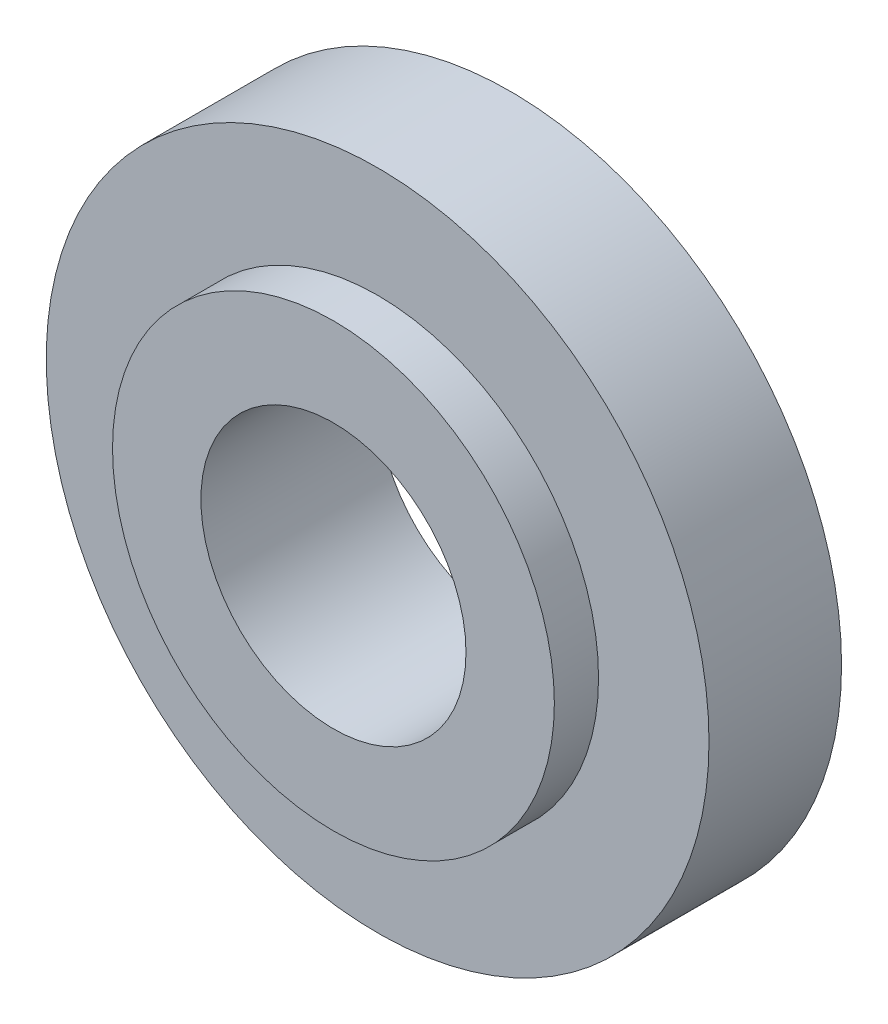
ISO-10303-21;
HEADER;
FILE_DESCRIPTION(('STEP AP214'),'2;1');
FILE_NAME('part.step','',(''),(''),'','','');
FILE_SCHEMA(('AUTOMOTIVE_DESIGN { 1 0 10303 214 1 1 1 1 }'));
ENDSEC;
DATA;
#1=APPLICATION_CONTEXT('core data for automotive mechanical design processes');
#2=APPLICATION_PROTOCOL_DEFINITION('international standard','automotive_design',2000,#1);
#3=PRODUCT_CONTEXT('',#1,'mechanical');
#4=PRODUCT('Part','Part','',(#3));
#5=PRODUCT_RELATED_PRODUCT_CATEGORY('part','',(#4));
#6=PRODUCT_DEFINITION_FORMATION('','',#4);
#7=PRODUCT_DEFINITION_CONTEXT('part definition',#1,'design');
#8=PRODUCT_DEFINITION('design','',#6,#7);
#9=PRODUCT_DEFINITION_SHAPE('','',#8);
#10=(LENGTH_UNIT() NAMED_UNIT(*) SI_UNIT(.MILLI.,.METRE.));
#11=(NAMED_UNIT(*) PLANE_ANGLE_UNIT() SI_UNIT($,.RADIAN.));
#12=(NAMED_UNIT(*) SI_UNIT($,.STERADIAN.) SOLID_ANGLE_UNIT());
#13=UNCERTAINTY_MEASURE_WITH_UNIT(LENGTH_MEASURE(1.E-05),#10,'distance_accuracy_value','');
#14=(GEOMETRIC_REPRESENTATION_CONTEXT(3) GLOBAL_UNCERTAINTY_ASSIGNED_CONTEXT((#13)) GLOBAL_UNIT_ASSIGNED_CONTEXT((#10,
#11,#12)) REPRESENTATION_CONTEXT('',''));
#15=CARTESIAN_POINT('',(0.,0.,0.));
#16=DIRECTION('',(0.,0.,1.));
#17=DIRECTION('',(1.,0.,0.));
#18=AXIS2_PLACEMENT_3D('',#15,#16,#17);
#19=CARTESIAN_POINT('',(0.,0.,2.14857369255151));
#20=DIRECTION('',(0.,0.,1.));
#21=DIRECTION('',(1.,0.,0.));
#22=AXIS2_PLACEMENT_3D('',#19,#20,#21);
#23=PLANE('',#22);
#24=CARTESIAN_POINT('',(0.,0.,2.14857369255151));
#25=DIRECTION('',(0.,0.,1.));
#26=DIRECTION('',(1.,0.,0.));
#27=AXIS2_PLACEMENT_3D('',#24,#25,#26);
#28=CIRCLE('',#27,7.5);
#29=CARTESIAN_POINT('',(7.5,0.,2.14857369255151));
#30=VERTEX_POINT('',#29);
#31=EDGE_CURVE('E10',#30,#30,#28,.T.);
#32=ORIENTED_EDGE('',*,*,#31,.T.);
#33=EDGE_LOOP('',(#32));
#34=FACE_BOUND('',#33,.T.);
#35=CARTESIAN_POINT('',(0.,0.,2.14857369255151));
#36=DIRECTION('',(0.,0.,1.));
#37=DIRECTION('',(1.,0.,0.));
#38=AXIS2_PLACEMENT_3D('',#35,#36,#37);
#39=CIRCLE('',#38,5.);
#40=CARTESIAN_POINT('',(5.,0.,2.14857369255151));
#41=VERTEX_POINT('',#40);
#42=EDGE_CURVE('E55',#41,#41,#39,.T.);
#43=ORIENTED_EDGE('',*,*,#42,.F.);
#44=EDGE_LOOP('',(#43));
#45=FACE_BOUND('',#44,.T.);
#46=ADVANCED_FACE('F36',(#34,#45),#23,.T.);
#47=CARTESIAN_POINT('',(0.,0.,-0.851426307448495));
#48=DIRECTION('',(0.,0.,1.));
#49=DIRECTION('',(1.,0.,0.));
#50=AXIS2_PLACEMENT_3D('',#47,#48,#49);
#51=PLANE('',#50);
#52=CARTESIAN_POINT('',(0.,0.,-0.851426307448495));
#53=DIRECTION('',(0.,0.,1.));
#54=DIRECTION('',(1.,0.,0.));
#55=AXIS2_PLACEMENT_3D('',#52,#53,#54);
#56=CIRCLE('',#55,7.5);
#57=CARTESIAN_POINT('',(7.5,0.,-0.851426307448495));
#58=VERTEX_POINT('',#57);
#59=EDGE_CURVE('E40',#58,#58,#56,.T.);
#60=ORIENTED_EDGE('',*,*,#59,.F.);
#61=EDGE_LOOP('',(#60));
#62=FACE_BOUND('',#61,.T.);
#63=CARTESIAN_POINT('',(0.,0.,-0.851426307448495));
#64=DIRECTION('',(0.,0.,1.));
#65=DIRECTION('',(1.,0.,0.));
#66=AXIS2_PLACEMENT_3D('',#63,#64,#65);
#67=CIRCLE('',#66,3.);
#68=CARTESIAN_POINT('',(3.,0.,-0.851426307448495));
#69=VERTEX_POINT('',#68);
#70=EDGE_CURVE('E49',#69,#69,#67,.T.);
#71=ORIENTED_EDGE('',*,*,#70,.T.);
#72=EDGE_LOOP('',(#71));
#73=FACE_BOUND('',#72,.T.);
#74=ADVANCED_FACE('F83',(#62,#73),#51,.F.);
#75=CARTESIAN_POINT('',(0.,0.,2.14857369255151));
#76=DIRECTION('',(0.,0.,-1.));
#77=DIRECTION('',(-1.,0.,0.));
#78=AXIS2_PLACEMENT_3D('',#75,#76,#77);
#79=CYLINDRICAL_SURFACE('',#78,7.5);
#80=ORIENTED_EDGE('',*,*,#31,.F.);
#81=EDGE_LOOP('',(#80));
#82=FACE_BOUND('',#81,.T.);
#83=ORIENTED_EDGE('',*,*,#59,.T.);
#84=EDGE_LOOP('',(#83));
#85=FACE_BOUND('',#84,.T.);
#86=ADVANCED_FACE('F38',(#82,#85),#79,.T.);
#87=CARTESIAN_POINT('',(0.,0.,2.14857369255151));
#88=DIRECTION('',(0.,0.,-1.));
#89=DIRECTION('',(-1.,0.,0.));
#90=AXIS2_PLACEMENT_3D('',#87,#88,#89);
#91=CYLINDRICAL_SURFACE('',#90,3.);
#92=ORIENTED_EDGE('',*,*,#70,.F.);
#93=EDGE_LOOP('',(#92));
#94=FACE_BOUND('',#93,.T.);
#95=CARTESIAN_POINT('',(0.,0.,3.14857369255151));
#96=DIRECTION('',(0.,0.,1.));
#97=DIRECTION('',(1.,0.,0.));
#98=AXIS2_PLACEMENT_3D('',#95,#96,#97);
#99=CIRCLE('',#98,3.);
#100=CARTESIAN_POINT('',(3.,0.,3.14857369255151));
#101=VERTEX_POINT('',#100);
#102=EDGE_CURVE('E59',#101,#101,#99,.T.);
#103=ORIENTED_EDGE('',*,*,#102,.T.);
#104=EDGE_LOOP('',(#103));
#105=FACE_BOUND('',#104,.T.);
#106=ADVANCED_FACE('F67',(#94,#105),#91,.F.);
#107=CARTESIAN_POINT('',(0.,0.,3.14857369255151));
#108=DIRECTION('',(0.,0.,1.));
#109=DIRECTION('',(1.,0.,0.));
#110=AXIS2_PLACEMENT_3D('',#107,#108,#109);
#111=PLANE('',#110);
#112=CARTESIAN_POINT('',(0.,0.,3.14857369255151));
#113=DIRECTION('',(0.,0.,1.));
#114=DIRECTION('',(1.,0.,0.));
#115=AXIS2_PLACEMENT_3D('',#112,#113,#114);
#116=CIRCLE('',#115,5.);
#117=CARTESIAN_POINT('',(5.,0.,3.14857369255151));
#118=VERTEX_POINT('',#117);
#119=EDGE_CURVE('E54',#118,#118,#116,.T.);
#120=ORIENTED_EDGE('',*,*,#119,.T.);
#121=EDGE_LOOP('',(#120));
#122=FACE_BOUND('',#121,.T.);
#123=ORIENTED_EDGE('',*,*,#102,.F.);
#124=EDGE_LOOP('',(#123));
#125=FACE_BOUND('',#124,.T.);
#126=ADVANCED_FACE('F69',(#122,#125),#111,.T.);
#127=CARTESIAN_POINT('',(0.,0.,3.14857369255151));
#128=DIRECTION('',(0.,0.,-1.));
#129=DIRECTION('',(-1.,0.,0.));
#130=AXIS2_PLACEMENT_3D('',#127,#128,#129);
#131=CYLINDRICAL_SURFACE('',#130,5.);
#132=ORIENTED_EDGE('',*,*,#119,.F.);
#133=EDGE_LOOP('',(#132));
#134=FACE_BOUND('',#133,.T.);
#135=ORIENTED_EDGE('',*,*,#42,.T.);
#136=EDGE_LOOP('',(#135));
#137=FACE_BOUND('',#136,.T.);
#138=ADVANCED_FACE('F71',(#134,#137),#131,.T.);
#139=CLOSED_SHELL('',(#46,#74,#86,#106,#126,#138));
#140=MANIFOLD_SOLID_BREP('B2',#139);
#141=ADVANCED_BREP_SHAPE_REPRESENTATION('',(#18,#140),#14);
#142=SHAPE_DEFINITION_REPRESENTATION(#9,#141);
ENDSEC;
END-ISO-10303-21;
